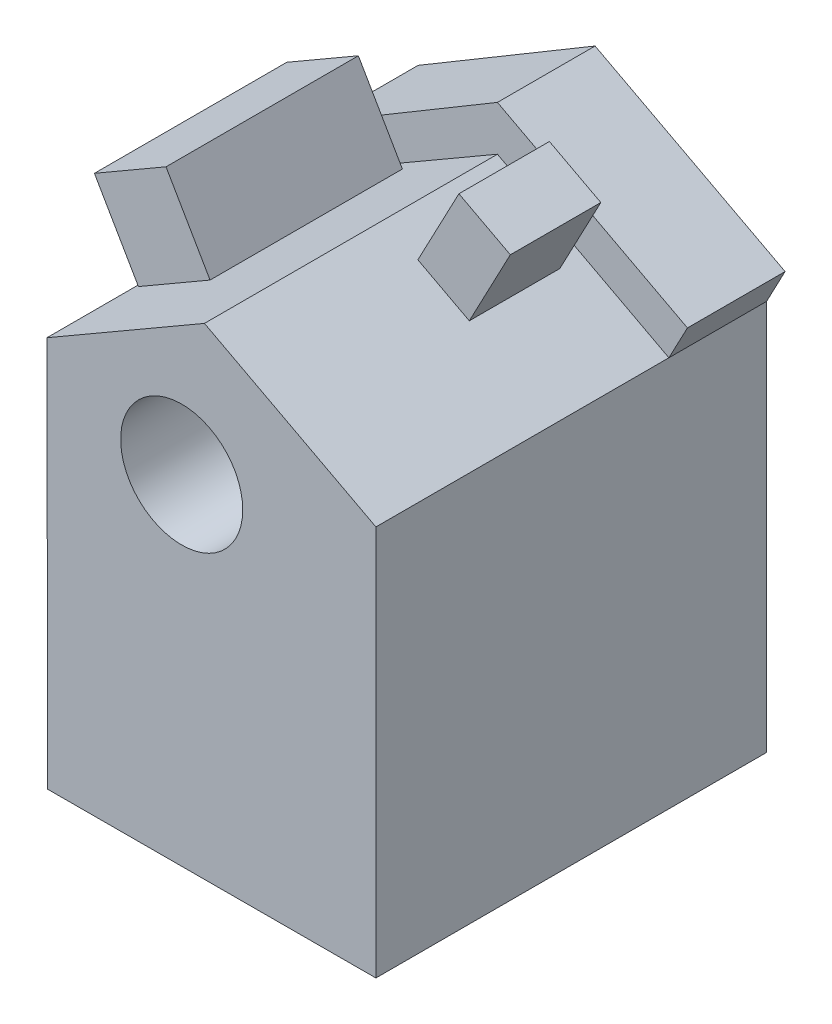
ISO-10303-21;
HEADER;
FILE_DESCRIPTION(('STEP AP214'),'2;1');
FILE_NAME('part.step','',(''),(''),'','','');
FILE_SCHEMA(('AUTOMOTIVE_DESIGN { 1 0 10303 214 1 1 1 1 }'));
ENDSEC;
DATA;
#1=APPLICATION_CONTEXT('core data for automotive mechanical design processes');
#2=APPLICATION_PROTOCOL_DEFINITION('international standard','automotive_design',2000,#1);
#3=PRODUCT_CONTEXT('',#1,'mechanical');
#4=PRODUCT('Part','Part','',(#3));
#5=PRODUCT_RELATED_PRODUCT_CATEGORY('part','',(#4));
#6=PRODUCT_DEFINITION_FORMATION('','',#4);
#7=PRODUCT_DEFINITION_CONTEXT('part definition',#1,'design');
#8=PRODUCT_DEFINITION('design','',#6,#7);
#9=PRODUCT_DEFINITION_SHAPE('','',#8);
#10=(LENGTH_UNIT() NAMED_UNIT(*) SI_UNIT(.MILLI.,.METRE.));
#11=(NAMED_UNIT(*) PLANE_ANGLE_UNIT() SI_UNIT($,.RADIAN.));
#12=(NAMED_UNIT(*) SI_UNIT($,.STERADIAN.) SOLID_ANGLE_UNIT());
#13=UNCERTAINTY_MEASURE_WITH_UNIT(LENGTH_MEASURE(1.E-05),#10,'distance_accuracy_value','');
#14=(GEOMETRIC_REPRESENTATION_CONTEXT(3) GLOBAL_UNCERTAINTY_ASSIGNED_CONTEXT((#13)) GLOBAL_UNIT_ASSIGNED_CONTEXT((#10,
#11,#12)) REPRESENTATION_CONTEXT('',''));
#15=CARTESIAN_POINT('',(0.,0.,0.));
#16=DIRECTION('',(0.,0.,1.));
#17=DIRECTION('',(1.,0.,0.));
#18=AXIS2_PLACEMENT_3D('',#15,#16,#17);
#19=CARTESIAN_POINT('',(-0.0798448426763646,40.,40.));
#20=DIRECTION('',(0.500965536134147,-0.865467233120831,0.));
#21=DIRECTION('',(0.865467233120831,0.500965536134147,0.));
#22=AXIS2_PLACEMENT_3D('',#19,#20,#21);
#23=PLANE('',#22);
#24=DIRECTION('',(0.,0.,-1.));
#25=VECTOR('',#24,1.);
#26=CARTESIAN_POINT('',(16.0514125560538,49.3373887560507,40.));
#27=LINE('',#26,#25);
#28=CARTESIAN_POINT('',(16.0514125560538,49.3373887560507,40.));
#29=VERTEX_POINT('',#28);
#30=CARTESIAN_POINT('',(16.0514125560538,49.3373887560507,10.));
#31=VERTEX_POINT('',#30);
#32=EDGE_CURVE('E299',#29,#31,#27,.T.);
#33=ORIENTED_EDGE('',*,*,#32,.T.);
#34=DIRECTION('',(0.865467233120831,0.500965536134147,0.));
#35=VECTOR('',#34,1.);
#36=CARTESIAN_POINT('',(16.0514125560538,49.3373887560507,10.));
#37=LINE('',#36,#35);
#38=CARTESIAN_POINT('',(-0.0798448426763646,40.,10.));
#39=VERTEX_POINT('',#38);
#40=EDGE_CURVE('E225',#39,#31,#37,.T.);
#41=ORIENTED_EDGE('',*,*,#40,.F.);
#42=DIRECTION('',(0.,0.,-1.));
#43=VECTOR('',#42,1.);
#44=CARTESIAN_POINT('',(-0.0798448426763646,40.,40.));
#45=LINE('',#44,#43);
#46=CARTESIAN_POINT('',(-0.0798448426763646,40.,40.));
#47=VERTEX_POINT('',#46);
#48=EDGE_CURVE('E292',#47,#39,#45,.T.);
#49=ORIENTED_EDGE('',*,*,#48,.F.);
#50=DIRECTION('',(-0.865467233120831,-0.500965536134147,0.));
#51=VECTOR('',#50,1.);
#52=CARTESIAN_POINT('',(-0.0798448426763646,40.,40.));
#53=LINE('',#52,#51);
#54=EDGE_CURVE('E290',#29,#47,#53,.T.);
#55=ORIENTED_EDGE('',*,*,#54,.F.);
#56=EDGE_LOOP('',(#33,#41,#49,#55));
#57=FACE_BOUND('',#56,.T.);
#58=DIRECTION('',(0.,0.,-1.));
#59=VECTOR('',#58,1.);
#60=CARTESIAN_POINT('',(7.61206875215821,44.4523737820076,11.2911038113452));
#61=LINE('',#60,#59);
#62=CARTESIAN_POINT('',(7.61206875215821,44.4523737820076,30.9863878389933));
#63=VERTEX_POINT('',#62);
#64=CARTESIAN_POINT('',(7.61206875215821,44.4523737820076,11.2911038113452));
#65=VERTEX_POINT('',#64);
#66=EDGE_CURVE('E185',#63,#65,#61,.T.);
#67=ORIENTED_EDGE('',*,*,#66,.F.);
#68=DIRECTION('',(0.865467233120831,0.500965536134147,0.));
#69=VECTOR('',#68,1.);
#70=CARTESIAN_POINT('',(0.280703133800127,40.2086989586958,30.9863878389933));
#71=LINE('',#70,#69);
#72=CARTESIAN_POINT('',(0.280703133800145,40.2086989586958,30.9863878389933));
#73=VERTEX_POINT('',#72);
#74=EDGE_CURVE('E182',#73,#63,#71,.T.);
#75=ORIENTED_EDGE('',*,*,#74,.F.);
#76=DIRECTION('',(0.,0.,1.));
#77=VECTOR('',#76,1.);
#78=CARTESIAN_POINT('',(0.280703133800127,40.2086989586958,11.2911038113452));
#79=LINE('',#78,#77);
#80=CARTESIAN_POINT('',(0.280703133800133,40.2086989586958,11.2911038113452));
#81=VERTEX_POINT('',#80);
#82=EDGE_CURVE('E57',#81,#73,#79,.T.);
#83=ORIENTED_EDGE('',*,*,#82,.F.);
#84=DIRECTION('',(-0.865467233120831,-0.500965536134147,0.));
#85=VECTOR('',#84,1.);
#86=CARTESIAN_POINT('',(0.280703133800127,40.2086989586958,11.2911038113452));
#87=LINE('',#86,#85);
#88=EDGE_CURVE('E52',#65,#81,#87,.T.);
#89=ORIENTED_EDGE('',*,*,#88,.F.);
#90=EDGE_LOOP('',(#67,#75,#83,#89));
#91=FACE_BOUND('',#90,.T.);
#92=ADVANCED_FACE('F37',(#57,#91),#23,.F.);
#93=CARTESIAN_POINT('',(16.0514125560538,49.3373887560507,40.));
#94=DIRECTION('',(-0.46688730081856,-0.884316825766851,0.));
#95=DIRECTION('',(0.884316825766851,-0.46688730081856,0.));
#96=AXIS2_PLACEMENT_3D('',#93,#94,#95);
#97=PLANE('',#96);
#98=DIRECTION('',(0.,0.,-1.));
#99=VECTOR('',#98,1.);
#100=CARTESIAN_POINT('',(33.61,40.0670896290588,40.));
#101=LINE('',#100,#99);
#102=CARTESIAN_POINT('',(33.61,40.0670896290588,40.));
#103=VERTEX_POINT('',#102);
#104=CARTESIAN_POINT('',(33.61,40.0670896290588,10.));
#105=VERTEX_POINT('',#104);
#106=EDGE_CURVE('E302',#103,#105,#101,.T.);
#107=ORIENTED_EDGE('',*,*,#106,.T.);
#108=DIRECTION('',(0.884316825766851,-0.46688730081856,0.));
#109=VECTOR('',#108,1.);
#110=CARTESIAN_POINT('',(16.0514125560538,49.3373887560507,10.));
#111=LINE('',#110,#109);
#112=EDGE_CURVE('E228',#31,#105,#111,.T.);
#113=ORIENTED_EDGE('',*,*,#112,.F.);
#114=ORIENTED_EDGE('',*,*,#32,.F.);
#115=DIRECTION('',(-0.884316825766851,0.46688730081856,0.));
#116=VECTOR('',#115,1.);
#117=CARTESIAN_POINT('',(16.0514125560538,49.3373887560507,40.));
#118=LINE('',#117,#116);
#119=EDGE_CURVE('E288',#103,#29,#118,.T.);
#120=ORIENTED_EDGE('',*,*,#119,.F.);
#121=EDGE_LOOP('',(#107,#113,#114,#120));
#122=FACE_BOUND('',#121,.T.);
#123=DIRECTION('',(0.,0.,-1.));
#124=VECTOR('',#123,1.);
#125=CARTESIAN_POINT('',(24.7774313100381,44.7303664488511,12.3402100787757));
#126=LINE('',#125,#124);
#127=CARTESIAN_POINT('',(24.7774313100381,44.7303664488511,21.6063111813014));
#128=VERTEX_POINT('',#127);
#129=CARTESIAN_POINT('',(24.7774313100381,44.7303664488511,12.3402100787757));
#130=VERTEX_POINT('',#129);
#131=EDGE_CURVE('E186',#128,#130,#126,.T.);
#132=ORIENTED_EDGE('',*,*,#131,.F.);
#133=DIRECTION('',(0.884316825766851,-0.46688730081856,0.));
#134=VECTOR('',#133,1.);
#135=CARTESIAN_POINT('',(19.5133430788825,47.5096146480287,21.6063111813014));
#136=LINE('',#135,#134);
#137=CARTESIAN_POINT('',(19.5133430788825,47.5096146480287,21.6063111813014));
#138=VERTEX_POINT('',#137);
#139=EDGE_CURVE('E199',#138,#128,#136,.T.);
#140=ORIENTED_EDGE('',*,*,#139,.F.);
#141=DIRECTION('',(0.,0.,1.));
#142=VECTOR('',#141,1.);
#143=CARTESIAN_POINT('',(19.5133430788825,47.5096146480287,12.3402100787757));
#144=LINE('',#143,#142);
#145=CARTESIAN_POINT('',(19.5133430788825,47.5096146480287,12.3402100787757));
#146=VERTEX_POINT('',#145);
#147=EDGE_CURVE('E208',#146,#138,#144,.T.);
#148=ORIENTED_EDGE('',*,*,#147,.F.);
#149=DIRECTION('',(-0.884316825766851,0.46688730081856,0.));
#150=VECTOR('',#149,1.);
#151=CARTESIAN_POINT('',(19.5133430788825,47.5096146480287,12.3402100787757));
#152=LINE('',#151,#150);
#153=EDGE_CURVE('E189',#130,#146,#152,.T.);
#154=ORIENTED_EDGE('',*,*,#153,.F.);
#155=EDGE_LOOP('',(#132,#140,#148,#154));
#156=FACE_BOUND('',#155,.T.);
#157=ADVANCED_FACE('F332',(#122,#156),#97,.F.);
#158=CARTESIAN_POINT('',(0.,0.,40.));
#159=DIRECTION('',(0.999998007756297,0.00199611709014949,0.));
#160=DIRECTION('',(-0.00199611709014949,0.999998007756297,0.));
#161=AXIS2_PLACEMENT_3D('',#158,#159,#160);
#162=PLANE('',#161);
#163=DIRECTION('',(0.,0.,-1.));
#164=VECTOR('',#163,1.);
#165=CARTESIAN_POINT('',(-0.0795582587416434,39.856429582618,10.));
#166=LINE('',#165,#164);
#167=CARTESIAN_POINT('',(-0.0795582587416423,39.856429582618,10.));
#168=VERTEX_POINT('',#167);
#169=CARTESIAN_POINT('',(-0.0795582587416434,39.856429582618,0.));
#170=VERTEX_POINT('',#169);
#171=EDGE_CURVE('E246',#168,#170,#166,.T.);
#172=ORIENTED_EDGE('',*,*,#171,.T.);
#173=DIRECTION('',(0.00199611709014949,-0.999998007756297,0.));
#174=VECTOR('',#173,1.);
#175=CARTESIAN_POINT('',(0.,0.,0.));
#176=LINE('',#175,#174);
#177=CARTESIAN_POINT('',(0.,0.,0.));
#178=VERTEX_POINT('',#177);
#179=EDGE_CURVE('E277',#170,#178,#176,.T.);
#180=ORIENTED_EDGE('',*,*,#179,.T.);
#181=DIRECTION('',(0.,0.,-1.));
#182=VECTOR('',#181,1.);
#183=CARTESIAN_POINT('',(0.,0.,40.));
#184=LINE('',#183,#182);
#185=CARTESIAN_POINT('',(0.,0.,40.));
#186=VERTEX_POINT('',#185);
#187=EDGE_CURVE('E11',#186,#178,#184,.T.);
#188=ORIENTED_EDGE('',*,*,#187,.F.);
#189=DIRECTION('',(0.00199611709014949,-0.999998007756297,0.));
#190=VECTOR('',#189,1.);
#191=CARTESIAN_POINT('',(0.,0.,40.));
#192=LINE('',#191,#190);
#193=EDGE_CURVE('E280',#47,#186,#192,.T.);
#194=ORIENTED_EDGE('',*,*,#193,.F.);
#195=ORIENTED_EDGE('',*,*,#48,.T.);
#196=DIRECTION('',(-0.00199611709014962,0.999998007756297,0.));
#197=VECTOR('',#196,1.);
#198=CARTESIAN_POINT('',(-0.0798448426763646,40.,10.));
#199=LINE('',#198,#197);
#200=EDGE_CURVE('E243',#168,#39,#199,.T.);
#201=ORIENTED_EDGE('',*,*,#200,.F.);
#202=EDGE_LOOP('',(#172,#180,#188,#194,#195,#201));
#203=FACE_BOUND('',#202,.T.);
#204=ADVANCED_FACE('F39',(#203),#162,.F.);
#205=CARTESIAN_POINT('',(0.,0.,40.));
#206=DIRECTION('',(-0.00199611709014955,0.999998007756297,0.));
#207=DIRECTION('',(-0.999998007756297,-0.00199611709014955,0.));
#208=AXIS2_PLACEMENT_3D('',#205,#206,#207);
#209=PLANE('',#208);
#210=DIRECTION('',(0.999998007756297,0.00199611709014955,0.));
#211=VECTOR('',#210,1.);
#212=CARTESIAN_POINT('',(0.,0.,0.));
#213=LINE('',#212,#211);
#214=CARTESIAN_POINT('',(33.61,0.0670896290588174,0.));
#215=VERTEX_POINT('',#214);
#216=EDGE_CURVE('E294',#178,#215,#213,.T.);
#217=ORIENTED_EDGE('',*,*,#216,.T.);
#218=DIRECTION('',(0.,0.,-1.));
#219=VECTOR('',#218,1.);
#220=CARTESIAN_POINT('',(33.61,0.0670896290588174,40.));
#221=LINE('',#220,#219);
#222=CARTESIAN_POINT('',(33.61,0.0670896290588174,40.));
#223=VERTEX_POINT('',#222);
#224=EDGE_CURVE('E45',#223,#215,#221,.T.);
#225=ORIENTED_EDGE('',*,*,#224,.F.);
#226=DIRECTION('',(0.999998007756297,0.00199611709014955,0.));
#227=VECTOR('',#226,1.);
#228=CARTESIAN_POINT('',(0.,0.,40.));
#229=LINE('',#228,#227);
#230=EDGE_CURVE('E283',#186,#223,#229,.T.);
#231=ORIENTED_EDGE('',*,*,#230,.F.);
#232=ORIENTED_EDGE('',*,*,#187,.T.);
#233=EDGE_LOOP('',(#217,#225,#231,#232));
#234=FACE_BOUND('',#233,.T.);
#235=ADVANCED_FACE('F342',(#234),#209,.F.);
#236=CARTESIAN_POINT('',(33.61,40.0670896290588,40.));
#237=DIRECTION('',(-1.,0.,0.));
#238=DIRECTION('',(0.,-1.,0.));
#239=AXIS2_PLACEMENT_3D('',#236,#237,#238);
#240=PLANE('',#239);
#241=DIRECTION('',(0.,1.,0.));
#242=VECTOR('',#241,1.);
#243=CARTESIAN_POINT('',(33.61,40.0670896290588,0.));
#244=LINE('',#243,#242);
#245=CARTESIAN_POINT('',(33.61,40.0670896290588,0.));
#246=VERTEX_POINT('',#245);
#247=EDGE_CURVE('E284',#215,#246,#244,.T.);
#248=ORIENTED_EDGE('',*,*,#247,.T.);
#249=DIRECTION('',(0.,0.,-1.));
#250=VECTOR('',#249,1.);
#251=CARTESIAN_POINT('',(33.61,40.0670896290588,10.));
#252=LINE('',#251,#250);
#253=EDGE_CURVE('E270',#105,#246,#252,.T.);
#254=ORIENTED_EDGE('',*,*,#253,.F.);
#255=ORIENTED_EDGE('',*,*,#106,.F.);
#256=DIRECTION('',(0.,1.,0.));
#257=VECTOR('',#256,1.);
#258=CARTESIAN_POINT('',(33.61,40.0670896290588,40.));
#259=LINE('',#258,#257);
#260=EDGE_CURVE('E286',#223,#103,#259,.T.);
#261=ORIENTED_EDGE('',*,*,#260,.F.);
#262=ORIENTED_EDGE('',*,*,#224,.T.);
#263=EDGE_LOOP('',(#248,#254,#255,#261,#262));
#264=FACE_BOUND('',#263,.T.);
#265=ADVANCED_FACE('F309',(#264),#240,.F.);
#266=CARTESIAN_POINT('',(0.,0.,40.));
#267=DIRECTION('',(0.,0.,-1.));
#268=DIRECTION('',(-1.,0.,0.));
#269=AXIS2_PLACEMENT_3D('',#266,#267,#268);
#270=PLANE('',#269);
#271=CARTESIAN_POINT('',(13.7229367182385,34.7698759225068,40.));
#272=DIRECTION('',(0.,0.,1.));
#273=DIRECTION('',(1.,0.,0.));
#274=AXIS2_PLACEMENT_3D('',#271,#272,#273);
#275=CIRCLE('',#274,6.25);
#276=CARTESIAN_POINT('',(19.9729367182385,34.7698759225068,40.));
#277=VERTEX_POINT('',#276);
#278=EDGE_CURVE('E273',#277,#277,#275,.T.);
#279=ORIENTED_EDGE('',*,*,#278,.F.);
#280=EDGE_LOOP('',(#279));
#281=FACE_BOUND('',#280,.T.);
#282=ORIENTED_EDGE('',*,*,#193,.T.);
#283=ORIENTED_EDGE('',*,*,#230,.T.);
#284=ORIENTED_EDGE('',*,*,#260,.T.);
#285=ORIENTED_EDGE('',*,*,#119,.T.);
#286=ORIENTED_EDGE('',*,*,#54,.T.);
#287=EDGE_LOOP('',(#282,#283,#284,#285,#286));
#288=FACE_BOUND('',#287,.T.);
#289=ADVANCED_FACE('F340',(#281,#288),#270,.F.);
#290=CARTESIAN_POINT('',(0.,0.,0.));
#291=DIRECTION('',(0.,0.,-1.));
#292=DIRECTION('',(-1.,0.,0.));
#293=AXIS2_PLACEMENT_3D('',#290,#291,#292);
#294=PLANE('',#293);
#295=ORIENTED_EDGE('',*,*,#179,.F.);
#296=DIRECTION('',(0.859493553401424,0.511146585297597,0.));
#297=VECTOR('',#296,1.);
#298=CARTESIAN_POINT('',(-0.100967763284807,39.8436972065613,0.));
#299=LINE('',#298,#297);
#300=CARTESIAN_POINT('',(-0.100967763284807,39.8436972065613,0.));
#301=VERTEX_POINT('',#300);
#302=EDGE_CURVE('E229',#301,#170,#299,.T.);
#303=ORIENTED_EDGE('',*,*,#302,.F.);
#304=DIRECTION('',(0.511146585297597,-0.859493553401424,0.));
#305=VECTOR('',#304,1.);
#306=CARTESIAN_POINT('',(-2.07152881469921,43.1571978128278,0.));
#307=LINE('',#306,#305);
#308=CARTESIAN_POINT('',(-2.07152881469921,43.1571978128278,0.));
#309=VERTEX_POINT('',#308);
#310=EDGE_CURVE('E252',#309,#301,#307,.T.);
#311=ORIENTED_EDGE('',*,*,#310,.F.);
#312=DIRECTION('',(-0.859493553401424,-0.511146585297597,0.));
#313=VECTOR('',#312,1.);
#314=CARTESIAN_POINT('',(16.0514125560543,53.9350326907617,0.));
#315=LINE('',#314,#313);
#316=CARTESIAN_POINT('',(16.0514125560543,53.9350326907617,0.));
#317=VERTEX_POINT('',#316);
#318=EDGE_CURVE('E250',#317,#309,#315,.T.);
#319=ORIENTED_EDGE('',*,*,#318,.F.);
#320=DIRECTION('',(-0.884316825766851,0.466887300818559,0.));
#321=VECTOR('',#320,1.);
#322=CARTESIAN_POINT('',(35.5082581974041,43.6625218900589,0.));
#323=LINE('',#322,#321);
#324=CARTESIAN_POINT('',(35.5082581974041,43.6625218900589,0.));
#325=VERTEX_POINT('',#324);
#326=EDGE_CURVE('E248',#325,#317,#323,.T.);
#327=ORIENTED_EDGE('',*,*,#326,.F.);
#328=DIRECTION('',(0.466887300818559,0.884316825766852,0.));
#329=VECTOR('',#328,1.);
#330=CARTESIAN_POINT('',(33.61,40.0670896290588,0.));
#331=LINE('',#330,#329);
#332=EDGE_CURVE('E224',#246,#325,#331,.T.);
#333=ORIENTED_EDGE('',*,*,#332,.F.);
#334=ORIENTED_EDGE('',*,*,#247,.F.);
#335=ORIENTED_EDGE('',*,*,#216,.F.);
#336=EDGE_LOOP('',(#295,#303,#311,#319,#327,#333,#334,#335));
#337=FACE_BOUND('',#336,.T.);
#338=ADVANCED_FACE('F315',(#337),#294,.T.);
#339=CARTESIAN_POINT('',(13.7229367182385,34.7698759225068,30.));
#340=DIRECTION('',(0.,0.,1.));
#341=DIRECTION('',(1.,0.,0.));
#342=AXIS2_PLACEMENT_3D('',#339,#340,#341);
#343=CYLINDRICAL_SURFACE('',#342,6.25);
#344=CARTESIAN_POINT('',(13.7229367182385,34.7698759225068,30.));
#345=DIRECTION('',(0.,0.,1.));
#346=DIRECTION('',(1.,0.,0.));
#347=AXIS2_PLACEMENT_3D('',#344,#345,#346);
#348=CIRCLE('',#347,6.25);
#349=CARTESIAN_POINT('',(19.9729367182385,34.7698759225068,30.));
#350=VERTEX_POINT('',#349);
#351=EDGE_CURVE('E274',#350,#350,#348,.T.);
#352=ORIENTED_EDGE('',*,*,#351,.F.);
#353=EDGE_LOOP('',(#352));
#354=FACE_BOUND('',#353,.T.);
#355=ORIENTED_EDGE('',*,*,#278,.T.);
#356=EDGE_LOOP('',(#355));
#357=FACE_BOUND('',#356,.T.);
#358=ADVANCED_FACE('F401',(#354,#357),#343,.F.);
#359=CARTESIAN_POINT('',(0.,0.,30.));
#360=DIRECTION('',(0.,0.,1.));
#361=DIRECTION('',(1.,0.,0.));
#362=AXIS2_PLACEMENT_3D('',#359,#360,#361);
#363=PLANE('',#362);
#364=ORIENTED_EDGE('',*,*,#351,.T.);
#365=EDGE_LOOP('',(#364));
#366=FACE_BOUND('',#365,.T.);
#367=ADVANCED_FACE('F389',(#366),#363,.T.);
#368=CARTESIAN_POINT('',(33.61,40.0670896290588,10.));
#369=DIRECTION('',(-0.884316825766852,0.466887300818559,0.));
#370=DIRECTION('',(-0.466887300818559,-0.884316825766852,0.));
#371=AXIS2_PLACEMENT_3D('',#368,#369,#370);
#372=PLANE('',#371);
#373=ORIENTED_EDGE('',*,*,#332,.T.);
#374=DIRECTION('',(0.,0.,-1.));
#375=VECTOR('',#374,1.);
#376=CARTESIAN_POINT('',(35.5082581974041,43.6625218900589,10.));
#377=LINE('',#376,#375);
#378=CARTESIAN_POINT('',(35.5082581974041,43.6625218900589,10.));
#379=VERTEX_POINT('',#378);
#380=EDGE_CURVE('E267',#379,#325,#377,.T.);
#381=ORIENTED_EDGE('',*,*,#380,.F.);
#382=DIRECTION('',(0.466887300818559,0.884316825766852,0.));
#383=VECTOR('',#382,1.);
#384=CARTESIAN_POINT('',(33.61,40.0670896290588,10.));
#385=LINE('',#384,#383);
#386=EDGE_CURVE('E232',#105,#379,#385,.T.);
#387=ORIENTED_EDGE('',*,*,#386,.F.);
#388=ORIENTED_EDGE('',*,*,#253,.T.);
#389=EDGE_LOOP('',(#373,#381,#387,#388));
#390=FACE_BOUND('',#389,.T.);
#391=ADVANCED_FACE('F320',(#390),#372,.F.);
#392=CARTESIAN_POINT('',(35.5082581974041,43.6625218900589,10.));
#393=DIRECTION('',(-0.466887300818559,-0.884316825766852,0.));
#394=DIRECTION('',(0.884316825766852,-0.466887300818559,0.));
#395=AXIS2_PLACEMENT_3D('',#392,#393,#394);
#396=PLANE('',#395);
#397=ORIENTED_EDGE('',*,*,#326,.T.);
#398=DIRECTION('',(0.,0.,-1.));
#399=VECTOR('',#398,1.);
#400=CARTESIAN_POINT('',(16.0514125560543,53.9350326907617,10.));
#401=LINE('',#400,#399);
#402=CARTESIAN_POINT('',(16.0514125560543,53.9350326907617,10.));
#403=VERTEX_POINT('',#402);
#404=EDGE_CURVE('E264',#403,#317,#401,.T.);
#405=ORIENTED_EDGE('',*,*,#404,.F.);
#406=DIRECTION('',(-0.884316825766851,0.466887300818559,0.));
#407=VECTOR('',#406,1.);
#408=CARTESIAN_POINT('',(35.5082581974041,43.6625218900589,10.));
#409=LINE('',#408,#407);
#410=EDGE_CURVE('E234',#379,#403,#409,.T.);
#411=ORIENTED_EDGE('',*,*,#410,.F.);
#412=ORIENTED_EDGE('',*,*,#380,.T.);
#413=EDGE_LOOP('',(#397,#405,#411,#412));
#414=FACE_BOUND('',#413,.T.);
#415=ADVANCED_FACE('F324',(#414),#396,.F.);
#416=CARTESIAN_POINT('',(16.0514125560543,53.9350326907617,10.));
#417=DIRECTION('',(0.511146585297597,-0.859493553401424,0.));
#418=DIRECTION('',(0.859493553401424,0.511146585297597,0.));
#419=AXIS2_PLACEMENT_3D('',#416,#417,#418);
#420=PLANE('',#419);
#421=ORIENTED_EDGE('',*,*,#318,.T.);
#422=DIRECTION('',(0.,0.,-1.));
#423=VECTOR('',#422,1.);
#424=CARTESIAN_POINT('',(-2.07152881469921,43.1571978128278,10.));
#425=LINE('',#424,#423);
#426=CARTESIAN_POINT('',(-2.07152881469921,43.1571978128278,10.));
#427=VERTEX_POINT('',#426);
#428=EDGE_CURVE('E261',#427,#309,#425,.T.);
#429=ORIENTED_EDGE('',*,*,#428,.F.);
#430=DIRECTION('',(-0.859493553401424,-0.511146585297597,0.));
#431=VECTOR('',#430,1.);
#432=CARTESIAN_POINT('',(16.0514125560543,53.9350326907617,10.));
#433=LINE('',#432,#431);
#434=EDGE_CURVE('E236',#403,#427,#433,.T.);
#435=ORIENTED_EDGE('',*,*,#434,.F.);
#436=ORIENTED_EDGE('',*,*,#404,.T.);
#437=EDGE_LOOP('',(#421,#429,#435,#436));
#438=FACE_BOUND('',#437,.T.);
#439=ADVANCED_FACE('F355',(#438),#420,.F.);
#440=CARTESIAN_POINT('',(-2.07152881469921,43.1571978128278,10.));
#441=DIRECTION('',(0.859493553401424,0.511146585297597,0.));
#442=DIRECTION('',(-0.511146585297597,0.859493553401424,0.));
#443=AXIS2_PLACEMENT_3D('',#440,#441,#442);
#444=PLANE('',#443);
#445=ORIENTED_EDGE('',*,*,#310,.T.);
#446=DIRECTION('',(0.,0.,-1.));
#447=VECTOR('',#446,1.);
#448=CARTESIAN_POINT('',(-0.100967763284807,39.8436972065613,10.));
#449=LINE('',#448,#447);
#450=CARTESIAN_POINT('',(-0.100967763284807,39.8436972065613,10.));
#451=VERTEX_POINT('',#450);
#452=EDGE_CURVE('E258',#451,#301,#449,.T.);
#453=ORIENTED_EDGE('',*,*,#452,.F.);
#454=DIRECTION('',(0.511146585297597,-0.859493553401424,0.));
#455=VECTOR('',#454,1.);
#456=CARTESIAN_POINT('',(-2.07152881469921,43.1571978128278,10.));
#457=LINE('',#456,#455);
#458=EDGE_CURVE('E238',#427,#451,#457,.T.);
#459=ORIENTED_EDGE('',*,*,#458,.F.);
#460=ORIENTED_EDGE('',*,*,#428,.T.);
#461=EDGE_LOOP('',(#445,#453,#459,#460));
#462=FACE_BOUND('',#461,.T.);
#463=ADVANCED_FACE('F353',(#462),#444,.F.);
#464=CARTESIAN_POINT('',(-0.100967763284807,39.8436972065613,10.));
#465=DIRECTION('',(-0.511146585297597,0.859493553401424,0.));
#466=DIRECTION('',(-0.859493553401424,-0.511146585297597,0.));
#467=AXIS2_PLACEMENT_3D('',#464,#465,#466);
#468=PLANE('',#467);
#469=ORIENTED_EDGE('',*,*,#302,.T.);
#470=ORIENTED_EDGE('',*,*,#171,.F.);
#471=DIRECTION('',(0.859493553401424,0.511146585297597,0.));
#472=VECTOR('',#471,1.);
#473=CARTESIAN_POINT('',(-0.100967763284807,39.8436972065613,10.));
#474=LINE('',#473,#472);
#475=EDGE_CURVE('E240',#451,#168,#474,.T.);
#476=ORIENTED_EDGE('',*,*,#475,.F.);
#477=ORIENTED_EDGE('',*,*,#452,.T.);
#478=EDGE_LOOP('',(#469,#470,#476,#477));
#479=FACE_BOUND('',#478,.T.);
#480=ADVANCED_FACE('F348',(#479),#468,.F.);
#481=CARTESIAN_POINT('',(0.,0.,10.));
#482=DIRECTION('',(0.,0.,1.));
#483=DIRECTION('',(1.,0.,0.));
#484=AXIS2_PLACEMENT_3D('',#481,#482,#483);
#485=PLANE('',#484);
#486=ORIENTED_EDGE('',*,*,#40,.T.);
#487=ORIENTED_EDGE('',*,*,#112,.T.);
#488=ORIENTED_EDGE('',*,*,#386,.T.);
#489=ORIENTED_EDGE('',*,*,#410,.T.);
#490=ORIENTED_EDGE('',*,*,#434,.T.);
#491=ORIENTED_EDGE('',*,*,#458,.T.);
#492=ORIENTED_EDGE('',*,*,#475,.T.);
#493=ORIENTED_EDGE('',*,*,#200,.T.);
#494=EDGE_LOOP('',(#486,#487,#488,#489,#490,#491,#492,#493));
#495=FACE_BOUND('',#494,.T.);
#496=ADVANCED_FACE('F328',(#495),#485,.T.);
#497=CARTESIAN_POINT('',(28.9794170174051,52.6892178807527,12.3402100787757));
#498=DIRECTION('',(-0.884316825766851,0.46688730081856,0.));
#499=DIRECTION('',(-0.46688730081856,-0.884316825766851,0.));
#500=AXIS2_PLACEMENT_3D('',#497,#498,#499);
#501=PLANE('',#500);
#502=ORIENTED_EDGE('',*,*,#131,.T.);
#503=DIRECTION('',(-0.46688730081856,-0.884316825766851,0.));
#504=VECTOR('',#503,1.);
#505=CARTESIAN_POINT('',(28.9794170174051,52.6892178807527,12.3402100787757));
#506=LINE('',#505,#504);
#507=CARTESIAN_POINT('',(28.9794170174051,52.6892178807527,12.3402100787757));
#508=VERTEX_POINT('',#507);
#509=EDGE_CURVE('E221',#508,#130,#506,.T.);
#510=ORIENTED_EDGE('',*,*,#509,.F.);
#511=DIRECTION('',(0.,0.,-1.));
#512=VECTOR('',#511,1.);
#513=CARTESIAN_POINT('',(28.9794170174051,52.6892178807527,12.3402100787757));
#514=LINE('',#513,#512);
#515=CARTESIAN_POINT('',(28.9794170174051,52.6892178807527,21.6063111813014));
#516=VERTEX_POINT('',#515);
#517=EDGE_CURVE('E195',#516,#508,#514,.T.);
#518=ORIENTED_EDGE('',*,*,#517,.F.);
#519=DIRECTION('',(-0.46688730081856,-0.884316825766851,0.));
#520=VECTOR('',#519,1.);
#521=CARTESIAN_POINT('',(28.9794170174051,52.6892178807527,21.6063111813014));
#522=LINE('',#521,#520);
#523=EDGE_CURVE('E204',#516,#128,#522,.T.);
#524=ORIENTED_EDGE('',*,*,#523,.T.);
#525=EDGE_LOOP('',(#502,#510,#518,#524));
#526=FACE_BOUND('',#525,.T.);
#527=ADVANCED_FACE('F442',(#526),#501,.F.);
#528=CARTESIAN_POINT('',(23.7153287862495,55.4684660799304,12.3402100787757));
#529=DIRECTION('',(0.,0.,1.));
#530=DIRECTION('',(1.,0.,0.));
#531=AXIS2_PLACEMENT_3D('',#528,#529,#530);
#532=PLANE('',#531);
#533=ORIENTED_EDGE('',*,*,#153,.T.);
#534=DIRECTION('',(-0.46688730081856,-0.884316825766851,0.));
#535=VECTOR('',#534,1.);
#536=CARTESIAN_POINT('',(23.7153287862495,55.4684660799304,12.3402100787757));
#537=LINE('',#536,#535);
#538=CARTESIAN_POINT('',(23.7153287862495,55.4684660799304,12.3402100787757));
#539=VERTEX_POINT('',#538);
#540=EDGE_CURVE('E218',#539,#146,#537,.T.);
#541=ORIENTED_EDGE('',*,*,#540,.F.);
#542=DIRECTION('',(-0.884316825766851,0.46688730081856,0.));
#543=VECTOR('',#542,1.);
#544=CARTESIAN_POINT('',(23.7153287862495,55.4684660799304,12.3402100787757));
#545=LINE('',#544,#543);
#546=EDGE_CURVE('E198',#508,#539,#545,.T.);
#547=ORIENTED_EDGE('',*,*,#546,.F.);
#548=ORIENTED_EDGE('',*,*,#509,.T.);
#549=EDGE_LOOP('',(#533,#541,#547,#548));
#550=FACE_BOUND('',#549,.T.);
#551=ADVANCED_FACE('F457',(#550),#532,.F.);
#552=CARTESIAN_POINT('',(23.7153287862495,55.4684660799304,12.3402100787757));
#553=DIRECTION('',(0.884316825766851,-0.46688730081856,0.));
#554=DIRECTION('',(0.46688730081856,0.884316825766851,0.));
#555=AXIS2_PLACEMENT_3D('',#552,#553,#554);
#556=PLANE('',#555);
#557=ORIENTED_EDGE('',*,*,#147,.T.);
#558=DIRECTION('',(-0.46688730081856,-0.884316825766851,0.));
#559=VECTOR('',#558,1.);
#560=CARTESIAN_POINT('',(23.7153287862495,55.4684660799304,21.6063111813014));
#561=LINE('',#560,#559);
#562=CARTESIAN_POINT('',(23.7153287862495,55.4684660799304,21.6063111813014));
#563=VERTEX_POINT('',#562);
#564=EDGE_CURVE('E215',#563,#138,#561,.T.);
#565=ORIENTED_EDGE('',*,*,#564,.F.);
#566=DIRECTION('',(0.,0.,1.));
#567=VECTOR('',#566,1.);
#568=CARTESIAN_POINT('',(23.7153287862495,55.4684660799304,12.3402100787757));
#569=LINE('',#568,#567);
#570=EDGE_CURVE('E201',#539,#563,#569,.T.);
#571=ORIENTED_EDGE('',*,*,#570,.F.);
#572=ORIENTED_EDGE('',*,*,#540,.T.);
#573=EDGE_LOOP('',(#557,#565,#571,#572));
#574=FACE_BOUND('',#573,.T.);
#575=ADVANCED_FACE('F467',(#574),#556,.F.);
#576=CARTESIAN_POINT('',(23.7153287862495,55.4684660799304,21.6063111813014));
#577=DIRECTION('',(0.,0.,-1.));
#578=DIRECTION('',(-1.,0.,0.));
#579=AXIS2_PLACEMENT_3D('',#576,#577,#578);
#580=PLANE('',#579);
#581=ORIENTED_EDGE('',*,*,#139,.T.);
#582=ORIENTED_EDGE('',*,*,#523,.F.);
#583=DIRECTION('',(0.884316825766851,-0.46688730081856,0.));
#584=VECTOR('',#583,1.);
#585=CARTESIAN_POINT('',(23.7153287862495,55.4684660799304,21.6063111813014));
#586=LINE('',#585,#584);
#587=EDGE_CURVE('E203',#563,#516,#586,.T.);
#588=ORIENTED_EDGE('',*,*,#587,.F.);
#589=ORIENTED_EDGE('',*,*,#564,.T.);
#590=EDGE_LOOP('',(#581,#582,#588,#589));
#591=FACE_BOUND('',#590,.T.);
#592=ADVANCED_FACE('F477',(#591),#580,.F.);
#593=CARTESIAN_POINT('',(28.0711711524139,53.1687388488375,0.));
#594=DIRECTION('',(0.46688730081856,0.884316825766851,0.));
#595=DIRECTION('',(-0.884316825766851,0.46688730081856,0.));
#596=AXIS2_PLACEMENT_3D('',#593,#594,#595);
#597=PLANE('',#596);
#598=ORIENTED_EDGE('',*,*,#517,.T.);
#599=ORIENTED_EDGE('',*,*,#546,.T.);
#600=ORIENTED_EDGE('',*,*,#570,.T.);
#601=ORIENTED_EDGE('',*,*,#587,.T.);
#602=EDGE_LOOP('',(#598,#599,#600,#601));
#603=FACE_BOUND('',#602,.T.);
#604=ADVANCED_FACE('F486',(#603),#597,.T.);
#605=CARTESIAN_POINT('',(3.10337892695089,52.2415788800951,11.2911038113452));
#606=DIRECTION('',(-0.865467233120831,-0.500965536134147,0.));
#607=DIRECTION('',(0.500965536134147,-0.865467233120831,0.));
#608=AXIS2_PLACEMENT_3D('',#605,#606,#607);
#609=PLANE('',#608);
#610=ORIENTED_EDGE('',*,*,#66,.T.);
#611=DIRECTION('',(0.500965536134147,-0.865467233120831,0.));
#612=VECTOR('',#611,1.);
#613=CARTESIAN_POINT('',(3.10337892695089,52.2415788800951,11.2911038113452));
#614=LINE('',#613,#612);
#615=CARTESIAN_POINT('',(3.10337892695089,52.2415788800951,11.2911038113452));
#616=VERTEX_POINT('',#615);
#617=EDGE_CURVE('E166',#616,#65,#614,.T.);
#618=ORIENTED_EDGE('',*,*,#617,.F.);
#619=DIRECTION('',(0.,0.,-1.));
#620=VECTOR('',#619,1.);
#621=CARTESIAN_POINT('',(3.10337892695089,52.2415788800951,11.2911038113452));
#622=LINE('',#621,#620);
#623=CARTESIAN_POINT('',(3.10337892695089,52.2415788800951,30.9863878389933));
#624=VERTEX_POINT('',#623);
#625=EDGE_CURVE('E173',#624,#616,#622,.T.);
#626=ORIENTED_EDGE('',*,*,#625,.F.);
#627=DIRECTION('',(0.500965536134147,-0.865467233120831,0.));
#628=VECTOR('',#627,1.);
#629=CARTESIAN_POINT('',(3.10337892695089,52.2415788800951,30.9863878389933));
#630=LINE('',#629,#628);
#631=EDGE_CURVE('E581',#624,#63,#630,.T.);
#632=ORIENTED_EDGE('',*,*,#631,.T.);
#633=EDGE_LOOP('',(#610,#618,#626,#632));
#634=FACE_BOUND('',#633,.T.);
#635=ADVANCED_FACE('F184',(#634),#609,.F.);
#636=CARTESIAN_POINT('',(-4.22798669140719,47.9979040567833,11.2911038113452));
#637=DIRECTION('',(0.,0.,1.));
#638=DIRECTION('',(1.,0.,0.));
#639=AXIS2_PLACEMENT_3D('',#636,#637,#638);
#640=PLANE('',#639);
#641=ORIENTED_EDGE('',*,*,#88,.T.);
#642=DIRECTION('',(0.500965536134147,-0.865467233120831,0.));
#643=VECTOR('',#642,1.);
#644=CARTESIAN_POINT('',(-4.22798669140719,47.9979040567833,11.2911038113452));
#645=LINE('',#644,#643);
#646=CARTESIAN_POINT('',(-4.22798669140719,47.9979040567833,11.2911038113452));
#647=VERTEX_POINT('',#646);
#648=EDGE_CURVE('E169',#647,#81,#645,.T.);
#649=ORIENTED_EDGE('',*,*,#648,.F.);
#650=DIRECTION('',(-0.865467233120831,-0.500965536134147,0.));
#651=VECTOR('',#650,1.);
#652=CARTESIAN_POINT('',(-4.22798669140719,47.9979040567833,11.2911038113452));
#653=LINE('',#652,#651);
#654=EDGE_CURVE('E162',#616,#647,#653,.T.);
#655=ORIENTED_EDGE('',*,*,#654,.F.);
#656=ORIENTED_EDGE('',*,*,#617,.T.);
#657=EDGE_LOOP('',(#641,#649,#655,#656));
#658=FACE_BOUND('',#657,.T.);
#659=ADVANCED_FACE('F164',(#658),#640,.F.);
#660=CARTESIAN_POINT('',(-4.22798669140719,47.9979040567833,11.2911038113452));
#661=DIRECTION('',(0.865467233120831,0.500965536134147,0.));
#662=DIRECTION('',(-0.500965536134147,0.865467233120831,0.));
#663=AXIS2_PLACEMENT_3D('',#660,#661,#662);
#664=PLANE('',#663);
#665=ORIENTED_EDGE('',*,*,#82,.T.);
#666=DIRECTION('',(0.500965536134147,-0.865467233120831,0.));
#667=VECTOR('',#666,1.);
#668=CARTESIAN_POINT('',(-4.22798669140719,47.9979040567833,30.9863878389933));
#669=LINE('',#668,#667);
#670=CARTESIAN_POINT('',(-4.22798669140719,47.9979040567833,30.9863878389933));
#671=VERTEX_POINT('',#670);
#672=EDGE_CURVE('E191',#671,#73,#669,.T.);
#673=ORIENTED_EDGE('',*,*,#672,.F.);
#674=DIRECTION('',(0.,0.,1.));
#675=VECTOR('',#674,1.);
#676=CARTESIAN_POINT('',(-4.22798669140719,47.9979040567833,11.2911038113452));
#677=LINE('',#676,#675);
#678=EDGE_CURVE('E172',#647,#671,#677,.T.);
#679=ORIENTED_EDGE('',*,*,#678,.F.);
#680=ORIENTED_EDGE('',*,*,#648,.T.);
#681=EDGE_LOOP('',(#665,#673,#679,#680));
#682=FACE_BOUND('',#681,.T.);
#683=ADVANCED_FACE('F509',(#682),#664,.F.);
#684=CARTESIAN_POINT('',(-4.22798669140719,47.9979040567833,30.9863878389933));
#685=DIRECTION('',(0.,0.,-1.));
#686=DIRECTION('',(-1.,0.,0.));
#687=AXIS2_PLACEMENT_3D('',#684,#685,#686);
#688=PLANE('',#687);
#689=ORIENTED_EDGE('',*,*,#74,.T.);
#690=ORIENTED_EDGE('',*,*,#631,.F.);
#691=DIRECTION('',(0.865467233120831,0.500965536134147,0.));
#692=VECTOR('',#691,1.);
#693=CARTESIAN_POINT('',(-4.22798669140719,47.9979040567833,30.9863878389933));
#694=LINE('',#693,#692);
#695=EDGE_CURVE('E178',#671,#624,#694,.T.);
#696=ORIENTED_EDGE('',*,*,#695,.F.);
#697=ORIENTED_EDGE('',*,*,#672,.T.);
#698=EDGE_LOOP('',(#689,#690,#696,#697));
#699=FACE_BOUND('',#698,.T.);
#700=ADVANCED_FACE('F516',(#699),#688,.F.);
#701=CARTESIAN_POINT('',(-21.8714984612698,37.7851646313909,0.));
#702=DIRECTION('',(-0.500965536134147,0.865467233120831,0.));
#703=DIRECTION('',(-0.865467233120831,-0.500965536134147,0.));
#704=AXIS2_PLACEMENT_3D('',#701,#702,#703);
#705=PLANE('',#704);
#706=ORIENTED_EDGE('',*,*,#625,.T.);
#707=ORIENTED_EDGE('',*,*,#654,.T.);
#708=ORIENTED_EDGE('',*,*,#678,.T.);
#709=ORIENTED_EDGE('',*,*,#695,.T.);
#710=EDGE_LOOP('',(#706,#707,#708,#709));
#711=FACE_BOUND('',#710,.T.);
#712=ADVANCED_FACE('F176',(#711),#705,.T.);
#713=CLOSED_SHELL('',(#92,#157,#204,#235,#265,#289,#338,#358,#367,#391,#415,#439,#463,#480,#496,
#527,#551,#575,#592,#604,#635,#659,#683,#700,#712));
#714=MANIFOLD_SOLID_BREP('B2',#713);
#715=ADVANCED_BREP_SHAPE_REPRESENTATION('',(#18,#714),#14);
#716=SHAPE_DEFINITION_REPRESENTATION(#9,#715);
ENDSEC;
END-ISO-10303-21;
